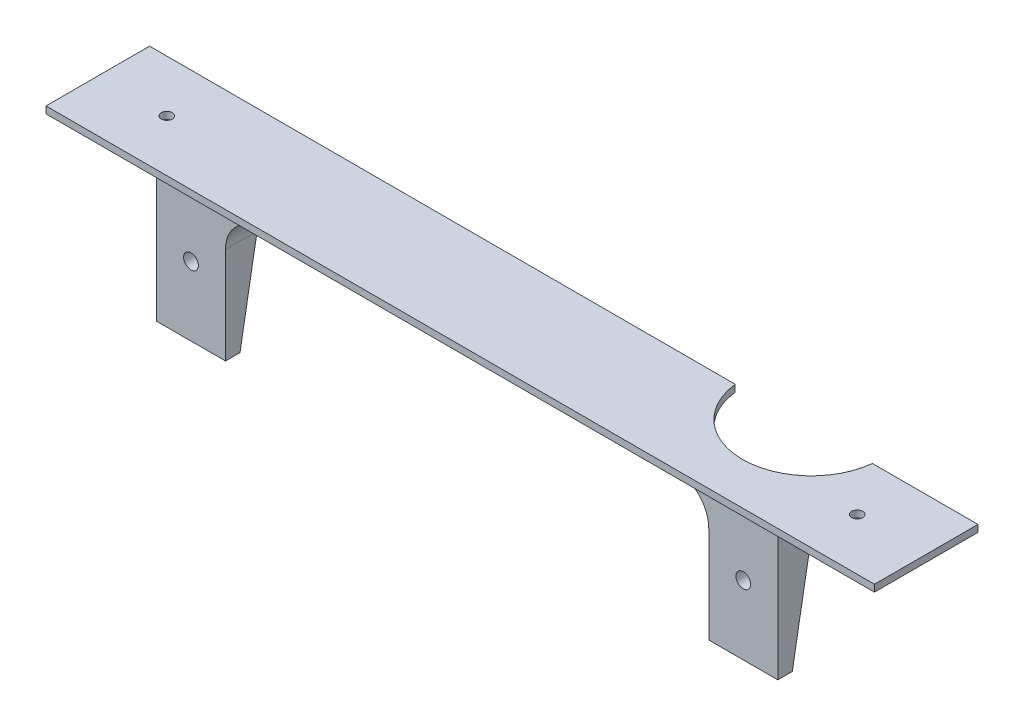
ISO-10303-21;
HEADER;
FILE_DESCRIPTION(('STEP AP214'),'2;1');
FILE_NAME('part.step','',(''),(''),'','','');
FILE_SCHEMA(('AUTOMOTIVE_DESIGN { 1 0 10303 214 1 1 1 1 }'));
ENDSEC;
DATA;
#1=APPLICATION_CONTEXT('core data for automotive mechanical design processes');
#2=APPLICATION_PROTOCOL_DEFINITION('international standard','automotive_design',2000,#1);
#3=PRODUCT_CONTEXT('',#1,'mechanical');
#4=PRODUCT('Part','Part','',(#3));
#5=PRODUCT_RELATED_PRODUCT_CATEGORY('part','',(#4));
#6=PRODUCT_DEFINITION_FORMATION('','',#4);
#7=PRODUCT_DEFINITION_CONTEXT('part definition',#1,'design');
#8=PRODUCT_DEFINITION('design','',#6,#7);
#9=PRODUCT_DEFINITION_SHAPE('','',#8);
#10=(LENGTH_UNIT() NAMED_UNIT(*) SI_UNIT(.MILLI.,.METRE.));
#11=(NAMED_UNIT(*) PLANE_ANGLE_UNIT() SI_UNIT($,.RADIAN.));
#12=(NAMED_UNIT(*) SI_UNIT($,.STERADIAN.) SOLID_ANGLE_UNIT());
#13=UNCERTAINTY_MEASURE_WITH_UNIT(LENGTH_MEASURE(1.E-05),#10,'distance_accuracy_value','');
#14=(GEOMETRIC_REPRESENTATION_CONTEXT(3) GLOBAL_UNCERTAINTY_ASSIGNED_CONTEXT((#13)) GLOBAL_UNIT_ASSIGNED_CONTEXT((#10,
#11,#12)) REPRESENTATION_CONTEXT('',''));
#15=CARTESIAN_POINT('',(0.,0.,0.));
#16=DIRECTION('',(0.,0.,1.));
#17=DIRECTION('',(1.,0.,0.));
#18=AXIS2_PLACEMENT_3D('',#15,#16,#17);
#19=CARTESIAN_POINT('',(0.,0.,-30.));
#20=DIRECTION('',(0.,0.,-1.));
#21=DIRECTION('',(-1.,0.,0.));
#22=AXIS2_PLACEMENT_3D('',#19,#20,#21);
#23=PLANE('',#22);
#24=DIRECTION('',(0.,1.,0.));
#25=VECTOR('',#24,1.);
#26=CARTESIAN_POINT('',(49.6713682563412,-9.,-30.));
#27=LINE('',#26,#25);
#28=CARTESIAN_POINT('',(49.6713682563412,-1.,-30.));
#29=VERTEX_POINT('',#28);
#30=CARTESIAN_POINT('',(49.6713682563412,1.,-30.));
#31=VERTEX_POINT('',#30);
#32=EDGE_CURVE('E179',#29,#31,#27,.T.);
#33=ORIENTED_EDGE('',*,*,#32,.F.);
#34=DIRECTION('',(1.,0.,0.));
#35=VECTOR('',#34,1.);
#36=CARTESIAN_POINT('',(-120.,-1.,-30.));
#37=LINE('',#36,#35);
#38=CARTESIAN_POINT('',(-120.,-1.,-30.));
#39=VERTEX_POINT('',#38);
#40=EDGE_CURVE('E213',#39,#29,#37,.T.);
#41=ORIENTED_EDGE('',*,*,#40,.F.);
#42=DIRECTION('',(0.,1.,0.));
#43=VECTOR('',#42,1.);
#44=CARTESIAN_POINT('',(-120.,-1.,-30.));
#45=LINE('',#44,#43);
#46=CARTESIAN_POINT('',(-120.,1.,-30.));
#47=VERTEX_POINT('',#46);
#48=EDGE_CURVE('E203',#39,#47,#45,.T.);
#49=ORIENTED_EDGE('',*,*,#48,.T.);
#50=DIRECTION('',(1.,0.,0.));
#51=VECTOR('',#50,1.);
#52=CARTESIAN_POINT('',(-120.,1.,-30.));
#53=LINE('',#52,#51);
#54=EDGE_CURVE('E197',#47,#31,#53,.T.);
#55=ORIENTED_EDGE('',*,*,#54,.T.);
#56=EDGE_LOOP('',(#33,#41,#49,#55));
#57=FACE_BOUND('',#56,.T.);
#58=ADVANCED_FACE('F43',(#57),#23,.T.);
#59=CARTESIAN_POINT('',(-90.,-39.,-1.2));
#60=DIRECTION('',(0.,-1.,0.));
#61=DIRECTION('',(0.,0.,-1.));
#62=AXIS2_PLACEMENT_3D('',#59,#60,#61);
#63=PLANE('',#62);
#64=DIRECTION('',(0.,0.,1.));
#65=VECTOR('',#64,1.);
#66=CARTESIAN_POINT('',(70.,-39.,-30.));
#67=LINE('',#66,#65);
#68=CARTESIAN_POINT('',(70.,-39.,-6.20423484597054));
#69=VERTEX_POINT('',#68);
#70=CARTESIAN_POINT('',(70.,-39.,-2.));
#71=VERTEX_POINT('',#70);
#72=EDGE_CURVE('E332',#69,#71,#67,.T.);
#73=ORIENTED_EDGE('',*,*,#72,.F.);
#74=DIRECTION('',(1.,0.,0.));
#75=VECTOR('',#74,1.);
#76=CARTESIAN_POINT('',(90.,-39.,-6.20423484597053));
#77=LINE('',#76,#75);
#78=CARTESIAN_POINT('',(90.,-39.,-6.20423484597053));
#79=VERTEX_POINT('',#78);
#80=EDGE_CURVE('E72',#69,#79,#77,.T.);
#81=ORIENTED_EDGE('',*,*,#80,.T.);
#82=DIRECTION('',(0.,0.,1.));
#83=VECTOR('',#82,1.);
#84=CARTESIAN_POINT('',(90.,-39.,-1.2));
#85=LINE('',#84,#83);
#86=CARTESIAN_POINT('',(90.,-39.,-2.));
#87=VERTEX_POINT('',#86);
#88=EDGE_CURVE('E358',#79,#87,#85,.T.);
#89=ORIENTED_EDGE('',*,*,#88,.T.);
#90=DIRECTION('',(1.,0.,0.));
#91=VECTOR('',#90,1.);
#92=CARTESIAN_POINT('',(-90.,-39.,-2.));
#93=LINE('',#92,#91);
#94=EDGE_CURVE('E341',#71,#87,#93,.T.);
#95=ORIENTED_EDGE('',*,*,#94,.F.);
#96=EDGE_LOOP('',(#73,#81,#89,#95));
#97=FACE_BOUND('',#96,.T.);
#98=ADVANCED_FACE('F423',(#97),#63,.T.);
#99=CARTESIAN_POINT('',(0.,0.,-2.));
#100=DIRECTION('',(0.,0.,1.));
#101=DIRECTION('',(1.,0.,0.));
#102=AXIS2_PLACEMENT_3D('',#99,#100,#101);
#103=PLANE('',#102);
#104=CARTESIAN_POINT('',(80.,-19.,-2.));
#105=DIRECTION('',(0.,0.,1.));
#106=DIRECTION('',(1.,0.,0.));
#107=AXIS2_PLACEMENT_3D('',#104,#105,#106);
#108=CIRCLE('',#107,2.15);
#109=CARTESIAN_POINT('',(82.15,-19.,-2.));
#110=VERTEX_POINT('',#109);
#111=EDGE_CURVE('E298',#110,#110,#108,.T.);
#112=ORIENTED_EDGE('',*,*,#111,.F.);
#113=EDGE_LOOP('',(#112));
#114=FACE_BOUND('',#113,.T.);
#115=DIRECTION('',(0.,1.,0.));
#116=VECTOR('',#115,1.);
#117=CARTESIAN_POINT('',(70.,-39.,-2.));
#118=LINE('',#117,#116);
#119=CARTESIAN_POINT('',(70.,-11.,-2.));
#120=VERTEX_POINT('',#119);
#121=EDGE_CURVE('E273',#71,#120,#118,.T.);
#122=ORIENTED_EDGE('',*,*,#121,.F.);
#123=ORIENTED_EDGE('',*,*,#94,.T.);
#124=DIRECTION('',(0.,1.,0.));
#125=VECTOR('',#124,1.);
#126=CARTESIAN_POINT('',(90.,-1.,-2.));
#127=LINE('',#126,#125);
#128=CARTESIAN_POINT('',(90.,-1.,-2.));
#129=VERTEX_POINT('',#128);
#130=EDGE_CURVE('E343',#87,#129,#127,.T.);
#131=ORIENTED_EDGE('',*,*,#130,.T.);
#132=DIRECTION('',(-1.,0.,0.));
#133=VECTOR('',#132,1.);
#134=CARTESIAN_POINT('',(-90.,-1.,-2.));
#135=LINE('',#134,#133);
#136=CARTESIAN_POINT('',(60.,-1.,-2.));
#137=VERTEX_POINT('',#136);
#138=EDGE_CURVE('E346',#129,#137,#135,.T.);
#139=ORIENTED_EDGE('',*,*,#138,.T.);
#140=CARTESIAN_POINT('',(60.,-11.,-2.));
#141=DIRECTION('',(0.,0.,1.));
#142=DIRECTION('',(1.,0.,0.));
#143=AXIS2_PLACEMENT_3D('',#140,#141,#142);
#144=CIRCLE('',#143,10.);
#145=EDGE_CURVE('E260',#137,#120,#144,.F.);
#146=ORIENTED_EDGE('',*,*,#145,.T.);
#147=EDGE_LOOP('',(#122,#123,#131,#139,#146));
#148=FACE_BOUND('',#147,.T.);
#149=ADVANCED_FACE('F406',(#114,#148),#103,.T.);
#150=CARTESIAN_POINT('',(90.,-1.00000000000001,-1.2));
#151=DIRECTION('',(-1.,0.,0.));
#152=DIRECTION('',(0.,-1.,0.));
#153=AXIS2_PLACEMENT_3D('',#150,#151,#152);
#154=PLANE('',#153);
#155=ORIENTED_EDGE('',*,*,#88,.F.);
#156=DIRECTION('',(0.,-0.98469102705284,0.174308867363719));
#157=VECTOR('',#156,1.);
#158=CARTESIAN_POINT('',(90.,-10.7623939346066,-11.2028232306471));
#159=LINE('',#158,#157);
#160=CARTESIAN_POINT('',(90.,-10.7623939346066,-11.2028232306472));
#161=VERTEX_POINT('',#160);
#162=EDGE_CURVE('E58',#79,#161,#159,.F.);
#163=ORIENTED_EDGE('',*,*,#162,.T.);
#164=CARTESIAN_POINT('',(90.,-11.,-21.2));
#165=DIRECTION('',(-1.,0.,0.));
#166=DIRECTION('',(0.,-1.,0.));
#167=AXIS2_PLACEMENT_3D('',#164,#165,#166);
#168=CIRCLE('',#167,10.);
#169=CARTESIAN_POINT('',(90.,-1.,-21.2));
#170=VERTEX_POINT('',#169);
#171=EDGE_CURVE('E262',#161,#170,#168,.T.);
#172=ORIENTED_EDGE('',*,*,#171,.T.);
#173=DIRECTION('',(0.,0.,1.));
#174=VECTOR('',#173,1.);
#175=CARTESIAN_POINT('',(90.,-1.00000000000001,-1.2));
#176=LINE('',#175,#174);
#177=EDGE_CURVE('E220',#170,#129,#176,.T.);
#178=ORIENTED_EDGE('',*,*,#177,.T.);
#179=ORIENTED_EDGE('',*,*,#130,.F.);
#180=EDGE_LOOP('',(#155,#163,#172,#178,#179));
#181=FACE_BOUND('',#180,.T.);
#182=ADVANCED_FACE('F363',(#181),#154,.F.);
#183=DIRECTION('',(0.,0.,1.));
#184=VECTOR('',#183,1.);
#185=CARTESIAN_POINT('',(-90.,-39.,-1.2));
#186=LINE('',#185,#184);
#187=CARTESIAN_POINT('',(-90.,-39.,-6.20423484597053));
#188=VERTEX_POINT('',#187);
#189=CARTESIAN_POINT('',(-90.,-39.,-2.));
#190=VERTEX_POINT('',#189);
#191=EDGE_CURVE('E356',#188,#190,#186,.T.);
#192=ORIENTED_EDGE('',*,*,#191,.F.);
#193=DIRECTION('',(1.,0.,0.));
#194=VECTOR('',#193,1.);
#195=CARTESIAN_POINT('',(-70.,-39.,-6.20423484597053));
#196=LINE('',#195,#194);
#197=CARTESIAN_POINT('',(-70.,-39.,-6.20423484597054));
#198=VERTEX_POINT('',#197);
#199=EDGE_CURVE('E281',#188,#198,#196,.T.);
#200=ORIENTED_EDGE('',*,*,#199,.T.);
#201=DIRECTION('',(0.,0.,1.));
#202=VECTOR('',#201,1.);
#203=CARTESIAN_POINT('',(-70.,-39.,-30.));
#204=LINE('',#203,#202);
#205=CARTESIAN_POINT('',(-70.,-39.,-2.));
#206=VERTEX_POINT('',#205);
#207=EDGE_CURVE('E319',#198,#206,#204,.T.);
#208=ORIENTED_EDGE('',*,*,#207,.T.);
#209=EDGE_CURVE('E330',#190,#206,#93,.T.);
#210=ORIENTED_EDGE('',*,*,#209,.F.);
#211=EDGE_LOOP('',(#192,#200,#208,#210));
#212=FACE_BOUND('',#211,.T.);
#213=ADVANCED_FACE('F418',(#212),#63,.T.);
#214=CARTESIAN_POINT('',(-90.,-1.00000000000001,-1.2));
#215=DIRECTION('',(-1.,0.,0.));
#216=DIRECTION('',(0.,0.,1.));
#217=AXIS2_PLACEMENT_3D('',#214,#215,#216);
#218=PLANE('',#217);
#219=CARTESIAN_POINT('',(-90.,-11.,-21.2));
#220=DIRECTION('',(-1.,0.,0.));
#221=DIRECTION('',(0.,0.,1.));
#222=AXIS2_PLACEMENT_3D('',#219,#220,#221);
#223=CIRCLE('',#222,10.);
#224=CARTESIAN_POINT('',(-90.,-1.00000000000001,-21.2));
#225=VERTEX_POINT('',#224);
#226=CARTESIAN_POINT('',(-90.,-10.7623939346066,-11.2028232306472));
#227=VERTEX_POINT('',#226);
#228=EDGE_CURVE('E267',#225,#227,#223,.F.);
#229=ORIENTED_EDGE('',*,*,#228,.T.);
#230=DIRECTION('',(0.,0.98469102705284,-0.174308867363719));
#231=VECTOR('',#230,1.);
#232=CARTESIAN_POINT('',(-90.,-3.01350484588724,-12.5745226198701));
#233=LINE('',#232,#231);
#234=EDGE_CURVE('E279',#227,#188,#233,.F.);
#235=ORIENTED_EDGE('',*,*,#234,.T.);
#236=ORIENTED_EDGE('',*,*,#191,.T.);
#237=DIRECTION('',(0.,-1.,0.));
#238=VECTOR('',#237,1.);
#239=CARTESIAN_POINT('',(-90.,-1.,-2.));
#240=LINE('',#239,#238);
#241=CARTESIAN_POINT('',(-90.,-1.00000000000001,-2.));
#242=VERTEX_POINT('',#241);
#243=EDGE_CURVE('E338',#242,#190,#240,.T.);
#244=ORIENTED_EDGE('',*,*,#243,.F.);
#245=DIRECTION('',(0.,0.,1.));
#246=VECTOR('',#245,1.);
#247=CARTESIAN_POINT('',(-90.,-1.00000000000001,-1.2));
#248=LINE('',#247,#246);
#249=EDGE_CURVE('E244',#225,#242,#248,.T.);
#250=ORIENTED_EDGE('',*,*,#249,.F.);
#251=EDGE_LOOP('',(#229,#235,#236,#244,#250));
#252=FACE_BOUND('',#251,.T.);
#253=ADVANCED_FACE('F415',(#252),#218,.T.);
#254=CARTESIAN_POINT('',(-120.,-1.,-30.));
#255=DIRECTION('',(0.,-1.,0.));
#256=DIRECTION('',(0.,0.,-1.));
#257=AXIS2_PLACEMENT_3D('',#254,#255,#256);
#258=PLANE('',#257);
#259=CARTESIAN_POINT('',(69.55,-1.,-32.2));
#260=DIRECTION('',(0.,-1.,0.));
#261=DIRECTION('',(0.,0.,-1.));
#262=AXIS2_PLACEMENT_3D('',#259,#260,#261);
#263=CIRCLE('',#262,20.);
#264=CARTESIAN_POINT('',(89.4286317436588,-1.,-30.));
#265=VERTEX_POINT('',#264);
#266=CARTESIAN_POINT('',(86.2532930884901,-0.999999999999999,-21.2));
#267=VERTEX_POINT('',#266);
#268=EDGE_CURVE('E376',#265,#267,#263,.T.);
#269=ORIENTED_EDGE('',*,*,#268,.F.);
#270=CARTESIAN_POINT('',(120.,-1.,-30.));
#271=VERTEX_POINT('',#270);
#272=EDGE_CURVE('E208',#265,#271,#37,.T.);
#273=ORIENTED_EDGE('',*,*,#272,.T.);
#274=DIRECTION('',(0.,0.,1.));
#275=VECTOR('',#274,1.);
#276=CARTESIAN_POINT('',(120.,-1.,-30.));
#277=LINE('',#276,#275);
#278=CARTESIAN_POINT('',(120.,-1.,0.));
#279=VERTEX_POINT('',#278);
#280=EDGE_CURVE('E229',#271,#279,#277,.T.);
#281=ORIENTED_EDGE('',*,*,#280,.T.);
#282=DIRECTION('',(1.,0.,0.));
#283=VECTOR('',#282,1.);
#284=CARTESIAN_POINT('',(-120.,-1.,0.));
#285=LINE('',#284,#283);
#286=CARTESIAN_POINT('',(-120.,-1.,0.));
#287=VERTEX_POINT('',#286);
#288=EDGE_CURVE('E226',#287,#279,#285,.T.);
#289=ORIENTED_EDGE('',*,*,#288,.F.);
#290=DIRECTION('',(0.,0.,1.));
#291=VECTOR('',#290,1.);
#292=CARTESIAN_POINT('',(-120.,-1.,-30.));
#293=LINE('',#292,#291);
#294=EDGE_CURVE('E215',#39,#287,#293,.T.);
#295=ORIENTED_EDGE('',*,*,#294,.F.);
#296=ORIENTED_EDGE('',*,*,#40,.T.);
#297=CARTESIAN_POINT('',(60.,-0.999999999999999,-14.6273650239926));
#298=VERTEX_POINT('',#297);
#299=EDGE_CURVE('E185',#298,#29,#263,.T.);
#300=ORIENTED_EDGE('',*,*,#299,.F.);
#301=DIRECTION('',(0.,0.,1.));
#302=VECTOR('',#301,1.);
#303=CARTESIAN_POINT('',(60.,-1.,-30.));
#304=LINE('',#303,#302);
#305=EDGE_CURVE('E253',#298,#137,#304,.T.);
#306=ORIENTED_EDGE('',*,*,#305,.T.);
#307=ORIENTED_EDGE('',*,*,#138,.F.);
#308=ORIENTED_EDGE('',*,*,#177,.F.);
#309=DIRECTION('',(1.,0.,0.));
#310=VECTOR('',#309,1.);
#311=CARTESIAN_POINT('',(70.,-1.,-21.2));
#312=LINE('',#311,#310);
#313=EDGE_CURVE('E250',#170,#267,#312,.F.);
#314=ORIENTED_EDGE('',*,*,#313,.T.);
#315=EDGE_LOOP('',(#269,#273,#281,#289,#295,#296,#300,#306,#307,#308,#314));
#316=FACE_BOUND('',#315,.T.);
#317=CARTESIAN_POINT('',(-60.,-1.,-2.));
#318=VERTEX_POINT('',#317);
#319=EDGE_CURVE('E345',#318,#242,#135,.T.);
#320=ORIENTED_EDGE('',*,*,#319,.F.);
#321=DIRECTION('',(0.,0.,1.));
#322=VECTOR('',#321,1.);
#323=CARTESIAN_POINT('',(-60.,-1.,-30.));
#324=LINE('',#323,#322);
#325=CARTESIAN_POINT('',(-60.,-1.,-21.2));
#326=VERTEX_POINT('',#325);
#327=EDGE_CURVE('E247',#318,#326,#324,.F.);
#328=ORIENTED_EDGE('',*,*,#327,.T.);
#329=DIRECTION('',(1.,0.,0.));
#330=VECTOR('',#329,1.);
#331=CARTESIAN_POINT('',(-90.,-1.,-21.2));
#332=LINE('',#331,#330);
#333=EDGE_CURVE('E236',#326,#225,#332,.F.);
#334=ORIENTED_EDGE('',*,*,#333,.T.);
#335=ORIENTED_EDGE('',*,*,#249,.T.);
#336=EDGE_LOOP('',(#320,#328,#334,#335));
#337=FACE_BOUND('',#336,.T.);
#338=CARTESIAN_POINT('',(-100.,-1.,-15.));
#339=DIRECTION('',(0.,-1.,0.));
#340=DIRECTION('',(0.,0.,-1.));
#341=AXIS2_PLACEMENT_3D('',#338,#339,#340);
#342=CIRCLE('',#341,1.6);
#343=CARTESIAN_POINT('',(-100.,-1.,-16.6));
#344=VERTEX_POINT('',#343);
#345=EDGE_CURVE('E240',#344,#344,#342,.T.);
#346=ORIENTED_EDGE('',*,*,#345,.F.);
#347=EDGE_LOOP('',(#346));
#348=FACE_BOUND('',#347,.T.);
#349=CARTESIAN_POINT('',(100.,-1.,-15.));
#350=DIRECTION('',(0.,-1.,0.));
#351=DIRECTION('',(0.,0.,-1.));
#352=AXIS2_PLACEMENT_3D('',#349,#350,#351);
#353=CIRCLE('',#352,1.6);
#354=CARTESIAN_POINT('',(100.,-1.,-16.6));
#355=VERTEX_POINT('',#354);
#356=EDGE_CURVE('E237',#355,#355,#353,.T.);
#357=ORIENTED_EDGE('',*,*,#356,.F.);
#358=EDGE_LOOP('',(#357));
#359=FACE_BOUND('',#358,.T.);
#360=ADVANCED_FACE('F369',(#316,#337,#348,#359),#258,.T.);
#361=CARTESIAN_POINT('',(-120.,-1.,-30.));
#362=DIRECTION('',(1.,0.,0.));
#363=DIRECTION('',(0.,0.,-1.));
#364=AXIS2_PLACEMENT_3D('',#361,#362,#363);
#365=PLANE('',#364);
#366=DIRECTION('',(0.,1.,0.));
#367=VECTOR('',#366,1.);
#368=CARTESIAN_POINT('',(-120.,-1.,0.));
#369=LINE('',#368,#367);
#370=CARTESIAN_POINT('',(-120.,1.,0.));
#371=VERTEX_POINT('',#370);
#372=EDGE_CURVE('E216',#287,#371,#369,.T.);
#373=ORIENTED_EDGE('',*,*,#372,.T.);
#374=DIRECTION('',(0.,0.,1.));
#375=VECTOR('',#374,1.);
#376=CARTESIAN_POINT('',(-120.,1.,-30.));
#377=LINE('',#376,#375);
#378=EDGE_CURVE('E234',#47,#371,#377,.T.);
#379=ORIENTED_EDGE('',*,*,#378,.F.);
#380=ORIENTED_EDGE('',*,*,#48,.F.);
#381=ORIENTED_EDGE('',*,*,#294,.T.);
#382=EDGE_LOOP('',(#373,#379,#380,#381));
#383=FACE_BOUND('',#382,.T.);
#384=ADVANCED_FACE('F436',(#383),#365,.F.);
#385=CARTESIAN_POINT('',(-120.,1.,-30.));
#386=DIRECTION('',(0.,-1.,0.));
#387=DIRECTION('',(0.,0.,-1.));
#388=AXIS2_PLACEMENT_3D('',#385,#386,#387);
#389=PLANE('',#388);
#390=CARTESIAN_POINT('',(-100.,1.,-15.));
#391=DIRECTION('',(0.,1.,0.));
#392=DIRECTION('',(0.,0.,1.));
#393=AXIS2_PLACEMENT_3D('',#390,#391,#392);
#394=CIRCLE('',#393,1.6);
#395=CARTESIAN_POINT('',(-100.,1.,-13.4));
#396=VERTEX_POINT('',#395);
#397=EDGE_CURVE('E241',#396,#396,#394,.T.);
#398=ORIENTED_EDGE('',*,*,#397,.F.);
#399=EDGE_LOOP('',(#398));
#400=FACE_BOUND('',#399,.T.);
#401=CARTESIAN_POINT('',(100.,1.,-15.));
#402=DIRECTION('',(0.,1.,0.));
#403=DIRECTION('',(0.,0.,1.));
#404=AXIS2_PLACEMENT_3D('',#401,#402,#403);
#405=CIRCLE('',#404,1.6);
#406=CARTESIAN_POINT('',(100.,1.,-13.4));
#407=VERTEX_POINT('',#406);
#408=EDGE_CURVE('E349',#407,#407,#405,.T.);
#409=ORIENTED_EDGE('',*,*,#408,.F.);
#410=EDGE_LOOP('',(#409));
#411=FACE_BOUND('',#410,.T.);
#412=CARTESIAN_POINT('',(89.4286317436588,1.,-30.));
#413=VERTEX_POINT('',#412);
#414=CARTESIAN_POINT('',(120.,1.,-30.));
#415=VERTEX_POINT('',#414);
#416=EDGE_CURVE('E200',#413,#415,#53,.T.);
#417=ORIENTED_EDGE('',*,*,#416,.F.);
#418=CARTESIAN_POINT('',(69.55,1.,-32.2));
#419=DIRECTION('',(0.,1.,0.));
#420=DIRECTION('',(0.,0.,-1.));
#421=AXIS2_PLACEMENT_3D('',#418,#419,#420);
#422=CIRCLE('',#421,20.);
#423=EDGE_CURVE('E182',#31,#413,#422,.T.);
#424=ORIENTED_EDGE('',*,*,#423,.F.);
#425=ORIENTED_EDGE('',*,*,#54,.F.);
#426=ORIENTED_EDGE('',*,*,#378,.T.);
#427=DIRECTION('',(1.,0.,0.));
#428=VECTOR('',#427,1.);
#429=CARTESIAN_POINT('',(-120.,1.,0.));
#430=LINE('',#429,#428);
#431=CARTESIAN_POINT('',(120.,1.,0.));
#432=VERTEX_POINT('',#431);
#433=EDGE_CURVE('E219',#371,#432,#430,.T.);
#434=ORIENTED_EDGE('',*,*,#433,.T.);
#435=DIRECTION('',(0.,0.,1.));
#436=VECTOR('',#435,1.);
#437=CARTESIAN_POINT('',(120.,1.,-30.));
#438=LINE('',#437,#436);
#439=EDGE_CURVE('E232',#415,#432,#438,.T.);
#440=ORIENTED_EDGE('',*,*,#439,.F.);
#441=EDGE_LOOP('',(#417,#424,#425,#426,#434,#440));
#442=FACE_BOUND('',#441,.T.);
#443=ADVANCED_FACE('F195',(#400,#411,#442),#389,.F.);
#444=CARTESIAN_POINT('',(120.,-1.,-30.));
#445=DIRECTION('',(1.,0.,0.));
#446=DIRECTION('',(0.,0.,-1.));
#447=AXIS2_PLACEMENT_3D('',#444,#445,#446);
#448=PLANE('',#447);
#449=DIRECTION('',(0.,1.,0.));
#450=VECTOR('',#449,1.);
#451=CARTESIAN_POINT('',(120.,-1.,0.));
#452=LINE('',#451,#450);
#453=EDGE_CURVE('E223',#279,#432,#452,.T.);
#454=ORIENTED_EDGE('',*,*,#453,.F.);
#455=ORIENTED_EDGE('',*,*,#280,.F.);
#456=DIRECTION('',(0.,1.,0.));
#457=VECTOR('',#456,1.);
#458=CARTESIAN_POINT('',(120.,-1.,-30.));
#459=LINE('',#458,#457);
#460=EDGE_CURVE('E205',#271,#415,#459,.T.);
#461=ORIENTED_EDGE('',*,*,#460,.T.);
#462=ORIENTED_EDGE('',*,*,#439,.T.);
#463=EDGE_LOOP('',(#454,#455,#461,#462));
#464=FACE_BOUND('',#463,.T.);
#465=ADVANCED_FACE('F429',(#464),#448,.T.);
#466=DIRECTION('',(0.,1.,0.));
#467=VECTOR('',#466,1.);
#468=CARTESIAN_POINT('',(89.4286317436588,-9.,-30.));
#469=LINE('',#468,#467);
#470=EDGE_CURVE('E191',#413,#265,#469,.F.);
#471=ORIENTED_EDGE('',*,*,#470,.F.);
#472=ORIENTED_EDGE('',*,*,#416,.T.);
#473=ORIENTED_EDGE('',*,*,#460,.F.);
#474=ORIENTED_EDGE('',*,*,#272,.F.);
#475=EDGE_LOOP('',(#471,#472,#473,#474));
#476=FACE_BOUND('',#475,.T.);
#477=ADVANCED_FACE('F426',(#476),#23,.T.);
#478=CARTESIAN_POINT('',(0.,0.,0.));
#479=DIRECTION('',(0.,0.,-1.));
#480=DIRECTION('',(-1.,0.,0.));
#481=AXIS2_PLACEMENT_3D('',#478,#479,#480);
#482=PLANE('',#481);
#483=ORIENTED_EDGE('',*,*,#288,.T.);
#484=ORIENTED_EDGE('',*,*,#453,.T.);
#485=ORIENTED_EDGE('',*,*,#433,.F.);
#486=ORIENTED_EDGE('',*,*,#372,.F.);
#487=EDGE_LOOP('',(#483,#484,#485,#486));
#488=FACE_BOUND('',#487,.T.);
#489=ADVANCED_FACE('F413',(#488),#482,.F.);
#490=CARTESIAN_POINT('',(100.,-39.,-15.));
#491=DIRECTION('',(0.,1.,0.));
#492=DIRECTION('',(0.,0.,1.));
#493=AXIS2_PLACEMENT_3D('',#490,#491,#492);
#494=CYLINDRICAL_SURFACE('',#493,1.6);
#495=ORIENTED_EDGE('',*,*,#356,.T.);
#496=EDGE_LOOP('',(#495));
#497=FACE_BOUND('',#496,.T.);
#498=ORIENTED_EDGE('',*,*,#408,.T.);
#499=EDGE_LOOP('',(#498));
#500=FACE_BOUND('',#499,.T.);
#501=ADVANCED_FACE('F409',(#497,#500),#494,.F.);
#502=CARTESIAN_POINT('',(-100.,-39.,-15.));
#503=DIRECTION('',(0.,1.,0.));
#504=DIRECTION('',(0.,0.,1.));
#505=AXIS2_PLACEMENT_3D('',#502,#503,#504);
#506=CYLINDRICAL_SURFACE('',#505,1.6);
#507=ORIENTED_EDGE('',*,*,#345,.T.);
#508=EDGE_LOOP('',(#507));
#509=FACE_BOUND('',#508,.T.);
#510=ORIENTED_EDGE('',*,*,#397,.T.);
#511=EDGE_LOOP('',(#510));
#512=FACE_BOUND('',#511,.T.);
#513=ADVANCED_FACE('F404',(#509,#512),#506,.F.);
#514=CARTESIAN_POINT('',(-80.,-19.,-2.));
#515=DIRECTION('',(0.,0.,1.));
#516=DIRECTION('',(1.,0.,0.));
#517=AXIS2_PLACEMENT_3D('',#514,#515,#516);
#518=CIRCLE('',#517,2.15);
#519=CARTESIAN_POINT('',(-77.85,-19.,-2.));
#520=VERTEX_POINT('',#519);
#521=EDGE_CURVE('E190',#520,#520,#518,.T.);
#522=ORIENTED_EDGE('',*,*,#521,.F.);
#523=EDGE_LOOP('',(#522));
#524=FACE_BOUND('',#523,.T.);
#525=DIRECTION('',(0.,-1.,0.));
#526=VECTOR('',#525,1.);
#527=CARTESIAN_POINT('',(-70.,-39.,-2.));
#528=LINE('',#527,#526);
#529=CARTESIAN_POINT('',(-70.,-11.,-2.));
#530=VERTEX_POINT('',#529);
#531=EDGE_CURVE('E326',#530,#206,#528,.T.);
#532=ORIENTED_EDGE('',*,*,#531,.F.);
#533=CARTESIAN_POINT('',(-60.,-11.,-2.));
#534=DIRECTION('',(0.,0.,1.));
#535=DIRECTION('',(1.,0.,0.));
#536=AXIS2_PLACEMENT_3D('',#533,#534,#535);
#537=CIRCLE('',#536,10.);
#538=EDGE_CURVE('E264',#530,#318,#537,.F.);
#539=ORIENTED_EDGE('',*,*,#538,.T.);
#540=ORIENTED_EDGE('',*,*,#319,.T.);
#541=ORIENTED_EDGE('',*,*,#243,.T.);
#542=ORIENTED_EDGE('',*,*,#209,.T.);
#543=EDGE_LOOP('',(#532,#539,#540,#541,#542));
#544=FACE_BOUND('',#543,.T.);
#545=ADVANCED_FACE('F327',(#524,#544),#103,.T.);
#546=CARTESIAN_POINT('',(70.,-39.,-30.));
#547=DIRECTION('',(1.,0.,0.));
#548=DIRECTION('',(0.,0.,-1.));
#549=AXIS2_PLACEMENT_3D('',#546,#547,#548);
#550=PLANE('',#549);
#551=DIRECTION('',(0.,0.,1.));
#552=VECTOR('',#551,1.);
#553=CARTESIAN_POINT('',(70.,-11.,-30.));
#554=LINE('',#553,#552);
#555=CARTESIAN_POINT('',(70.,-11.,-11.1607624796099));
#556=VERTEX_POINT('',#555);
#557=EDGE_CURVE('E255',#120,#556,#554,.F.);
#558=ORIENTED_EDGE('',*,*,#557,.T.);
#559=DIRECTION('',(0.,0.98469102705284,-0.174308867363719));
#560=VECTOR('',#559,1.);
#561=CARTESIAN_POINT('',(70.,-10.7623939346066,-11.2028232306472));
#562=LINE('',#561,#560);
#563=EDGE_CURVE('E292',#556,#69,#562,.F.);
#564=ORIENTED_EDGE('',*,*,#563,.T.);
#565=ORIENTED_EDGE('',*,*,#72,.T.);
#566=ORIENTED_EDGE('',*,*,#121,.T.);
#567=EDGE_LOOP('',(#558,#564,#565,#566));
#568=FACE_BOUND('',#567,.T.);
#569=ADVANCED_FACE('F398',(#568),#550,.F.);
#570=CARTESIAN_POINT('',(-70.,-39.,-30.));
#571=DIRECTION('',(-1.,0.,0.));
#572=DIRECTION('',(0.,0.,1.));
#573=AXIS2_PLACEMENT_3D('',#570,#571,#572);
#574=PLANE('',#573);
#575=ORIENTED_EDGE('',*,*,#207,.F.);
#576=DIRECTION('',(0.,-0.98469102705284,0.174308867363719));
#577=VECTOR('',#576,1.);
#578=CARTESIAN_POINT('',(-70.,-10.7623939346066,-11.2028232306472));
#579=LINE('',#578,#577);
#580=CARTESIAN_POINT('',(-70.,-11.,-11.1607624796099));
#581=VERTEX_POINT('',#580);
#582=EDGE_CURVE('E283',#198,#581,#579,.F.);
#583=ORIENTED_EDGE('',*,*,#582,.T.);
#584=DIRECTION('',(0.,0.,1.));
#585=VECTOR('',#584,1.);
#586=CARTESIAN_POINT('',(-70.,-11.,-30.));
#587=LINE('',#586,#585);
#588=EDGE_CURVE('E258',#581,#530,#587,.T.);
#589=ORIENTED_EDGE('',*,*,#588,.T.);
#590=ORIENTED_EDGE('',*,*,#531,.T.);
#591=EDGE_LOOP('',(#575,#583,#589,#590));
#592=FACE_BOUND('',#591,.T.);
#593=ADVANCED_FACE('F316',(#592),#574,.F.);
#594=CARTESIAN_POINT('',(0.,-11.,-21.2));
#595=DIRECTION('',(-1.,0.,0.));
#596=DIRECTION('',(0.,0.,1.));
#597=AXIS2_PLACEMENT_3D('',#594,#595,#596);
#598=CYLINDRICAL_SURFACE('',#597,10.);
#599=CARTESIAN_POINT('',(60.,-11.,-21.2));
#600=DIRECTION('',(-0.707106781186547,0.,0.707106781186547));
#601=DIRECTION('',(-0.707106781186547,0.,-0.707106781186547));
#602=AXIS2_PLACEMENT_3D('',#599,#600,#601);
#603=ELLIPSE('',#602,14.1421356237309,10.);
#604=CARTESIAN_POINT('',(68.9922205388166,-6.62507488277981,-12.2077794611834));
#605=VERTEX_POINT('',#604);
#606=CARTESIAN_POINT('',(69.9971767693528,-10.7623939346066,-11.2028232306472));
#607=VERTEX_POINT('',#606);
#608=EDGE_CURVE('E271',#605,#607,#603,.F.);
#609=ORIENTED_EDGE('',*,*,#608,.F.);
#610=CARTESIAN_POINT('',(59.82,-3.37816598697512,-14.7263884671771));
#611=CARTESIAN_POINT('',(60.076401689746,-3.49939997912934,-14.5836314332797));
#612=CARTESIAN_POINT('',(60.3352487332298,-3.62247680543249,-14.4468709312497));
#613=CARTESIAN_POINT('',(60.8578556080008,-3.87080858025255,-14.1852232331236));
#614=CARTESIAN_POINT('',(61.1216154441157,-3.99606353090986,-14.0603360486959));
#615=CARTESIAN_POINT('',(61.6558331951716,-4.24807578006461,-13.8215270826764));
#616=CARTESIAN_POINT('',(61.9263239078262,-4.37483753412172,-13.7076834263854));
#617=CARTESIAN_POINT('',(62.4724956309269,-4.6272557465506,-13.4918422076408));
#618=CARTESIAN_POINT('',(62.7481765750238,-4.75291221902164,-13.3898444938739));
#619=CARTESIAN_POINT('',(63.3186157659656,-5.00705938164491,-13.193020441187));
#620=CARTESIAN_POINT('',(63.6136496248372,-5.1353905367169,-13.0987844241712));
#621=CARTESIAN_POINT('',(64.2104055185978,-5.38555378652067,-12.9234476938633));
#622=CARTESIAN_POINT('',(64.5121288284846,-5.50738462696498,-12.8423495095175));
#623=CARTESIAN_POINT('',(65.121950275497,-5.74032976711845,-12.6938325814801));
#624=CARTESIAN_POINT('',(65.4300265242588,-5.85147517896734,-12.6263734514034));
#625=CARTESIAN_POINT('',(66.0538491435141,-6.0585348688835,-12.5053868346428));
#626=CARTESIAN_POINT('',(66.3695910906712,-6.15445770080572,-12.4518515130249));
#627=CARTESIAN_POINT('',(66.9768915688917,-6.31659730473677,-12.3640848316925));
#628=CARTESIAN_POINT('',(67.2677005686838,-6.38482826410956,-12.3284561314819));
#629=CARTESIAN_POINT('',(67.8548955870469,-6.49940136255764,-12.2697818635934));
#630=CARTESIAN_POINT('',(68.1512802199398,-6.54574886737771,-12.2467332111163));
#631=CARTESIAN_POINT('',(68.7430656021149,-6.61190071296601,-12.214124165353));
#632=CARTESIAN_POINT('',(69.0384080182046,-6.6321125335401,-12.2043565803552));
#633=CARTESIAN_POINT('',(69.6298643874267,-6.64528052034402,-12.1979733464491));
#634=CARTESIAN_POINT('',(69.9259783416179,-6.63823664915429,-12.201357715597));
#635=CARTESIAN_POINT('',(70.5161414002466,-6.59761482867327,-12.2211646909001));
#636=CARTESIAN_POINT('',(70.810188462238,-6.56401357518414,-12.2375987482624));
#637=CARTESIAN_POINT('',(71.3936346341255,-6.47344364111362,-12.2830045384497));
#638=CARTESIAN_POINT('',(71.6830327597637,-6.4164700782482,-12.3119788909093));
#639=CARTESIAN_POINT('',(72.2585517479584,-6.28294662276932,-12.3821138970972));
#640=CARTESIAN_POINT('',(72.5446169024298,-6.20621917173917,-12.4233856455247));
#641=CARTESIAN_POINT('',(73.110519787525,-6.03798383188012,-12.5173925803374));
#642=CARTESIAN_POINT('',(73.3903544038867,-5.9464687323006,-12.5701333636119));
#643=CARTESIAN_POINT('',(73.937533484433,-5.75490336545164,-12.6852386153417));
#644=CARTESIAN_POINT('',(74.2050171974387,-5.65509755335082,-12.7473540898915));
#645=CARTESIAN_POINT('',(74.7345089786172,-5.44827616643482,-12.8817325260063));
#646=CARTESIAN_POINT('',(74.9965179468958,-5.34126178920006,-12.9539938041712));
#647=CARTESIAN_POINT('',(75.515769775203,-5.12236569010062,-13.1085611973987));
#648=CARTESIAN_POINT('',(75.7730082378115,-5.01047976753556,-13.1908760966136));
#649=CARTESIAN_POINT('',(76.2828531340926,-4.78390024544104,-13.365423554329));
#650=CARTESIAN_POINT('',(76.5354590569389,-4.66920633949502,-13.4576571989553));
#651=CARTESIAN_POINT('',(77.286539332124,-4.32353348248506,-13.7491308007556));
#652=CARTESIAN_POINT('',(77.7785510649435,-4.09084352157979,-13.9632255065759));
#653=CARTESIAN_POINT('',(78.7458109959895,-3.6316325294851,-14.4313359177082));
#654=CARTESIAN_POINT('',(79.2210681767768,-3.40510820805064,-14.685329820859));
#655=CARTESIAN_POINT('',(80.0744126582862,-3.00437269082088,-15.187127325687));
#656=CARTESIAN_POINT('',(80.455183781402,-2.82785332047632,-15.4285190467695));
#657=CARTESIAN_POINT('',(81.2040422446959,-2.48965394134048,-15.939960838397));
#658=CARTESIAN_POINT('',(81.5721280646615,-2.32797570728212,-16.2100143280697));
#659=CARTESIAN_POINT('',(82.2922558968035,-2.02518894092643,-16.7778018667134));
#660=CARTESIAN_POINT('',(82.644363461159,-1.88398990305261,-17.0754039670587));
#661=CARTESIAN_POINT('',(83.3319984550978,-1.62671354646395,-17.6992492786117));
#662=CARTESIAN_POINT('',(83.667532409046,-1.51062628044464,-18.0254810767394));
#663=CARTESIAN_POINT('',(84.1989648849911,-1.34664385391805,-18.5802980006371));
#664=CARTESIAN_POINT('',(84.400736638829,-1.28938680322264,-18.8005402963345));
#665=CARTESIAN_POINT('',(84.7956302254085,-1.18892570371787,-19.251619154664));
#666=CARTESIAN_POINT('',(84.9887555371697,-1.14571595814962,-19.4824513791983));
#667=CARTESIAN_POINT('',(85.3667219843244,-1.07481722087557,-19.9556751468688));
#668=CARTESIAN_POINT('',(85.5515006272918,-1.04723166285283,-20.1981324572464));
#669=CARTESIAN_POINT('',(85.910578633201,-1.00981321745722,-20.6923837796938));
#670=CARTESIAN_POINT('',(86.0848666700679,-0.999999195983352,-20.9441874246993));
#671=CARTESIAN_POINT('',(86.2532930884901,-0.999999999999999,-21.2));
#672=B_SPLINE_CURVE_WITH_KNOTS('',3,(#610,#611,#612,#613,#614,#615,#616,#617,#618,#619,#620,
#621,#622,#623,#624,#625,#626,#627,#628,#629,#630,#631,#632,#633,#634,#635,#636,#637,#638,#639,
#640,#641,#642,#643,#644,#645,#646,#647,#648,#649,#650,#651,#652,#653,#654,#655,#656,#657,#658,
#659,#660,#661,#662,#663,#664,#665,#666,#667,#668,#669,#670,#671),.UNSPECIFIED.,.F.,.F.,(4,2,2,
2,2,2,2,2,2,2,2,2,2,2,2,2,2,2,2,2,2,2,2,2,2,2,2,2,2,2,4),(0.,0.952464231119473,1.90492939825257,
2.86370450601539,3.8224673655909,4.82787538615053,5.83347671175519,6.83605529181969,
7.83806849386447,8.7396121403903,9.64093461669513,10.528028129461,11.4151228601249,
12.3029968849939,13.1910564739948,14.0873954589168,14.9841728428192,15.8603430084759,
16.7363679706691,17.6131638926888,18.490055923877,20.2429096213121,21.9948088155979,
23.4461926860704,24.8977498904587,26.3426827023738,27.787042093416,28.6988933776021,
29.6103744060179,30.5278210421848,31.4462410512083),.UNSPECIFIED.);
#673=EDGE_CURVE('E65',#605,#267,#672,.T.);
#674=ORIENTED_EDGE('',*,*,#673,.T.);
#675=ORIENTED_EDGE('',*,*,#313,.F.);
#676=ORIENTED_EDGE('',*,*,#171,.F.);
#677=DIRECTION('',(-1.,0.,0.));
#678=VECTOR('',#677,1.);
#679=CARTESIAN_POINT('',(0.,-10.7623939346066,-11.2028232306472));
#680=LINE('',#679,#678);
#681=EDGE_CURVE('E287',#161,#607,#680,.T.);
#682=ORIENTED_EDGE('',*,*,#681,.T.);
#683=EDGE_LOOP('',(#609,#674,#675,#676,#682));
#684=FACE_BOUND('',#683,.T.);
#685=ADVANCED_FACE('F373',(#684),#598,.F.);
#686=CARTESIAN_POINT('',(60.,-11.,-30.));
#687=DIRECTION('',(0.,0.,1.));
#688=DIRECTION('',(1.,0.,0.));
#689=AXIS2_PLACEMENT_3D('',#686,#687,#688);
#690=CYLINDRICAL_SURFACE('',#689,10.);
#691=ORIENTED_EDGE('',*,*,#305,.F.);
#692=CARTESIAN_POINT('',(60.,-0.999999999999999,-14.6273650239926));
#693=CARTESIAN_POINT('',(60.2415197316132,-0.999969616109192,-14.496058827349));
#694=CARTESIAN_POINT('',(60.4858521525286,-1.0087502470795,-14.3697737622747));
#695=CARTESIAN_POINT('',(60.9785133577763,-1.0449309572061,-14.1277974112286));
#696=CARTESIAN_POINT('',(61.2268443128893,-1.07234150769712,-14.0121121246035));
#697=CARTESIAN_POINT('',(61.7258444596012,-1.14681854243101,-13.7919271636662));
#698=CARTESIAN_POINT('',(61.9765157205183,-1.19390443639754,-13.6874386632248));
#699=CARTESIAN_POINT('',(62.4777857512015,-1.30842394829451,-13.4902089844879));
#700=CARTESIAN_POINT('',(62.7283845252515,-1.37585336471436,-13.3974653861491));
#701=CARTESIAN_POINT('',(63.2282186390191,-1.53176910663706,-13.2235573819091));
#702=CARTESIAN_POINT('',(63.4774451326256,-1.62033476617103,-13.1424384904533));
#703=CARTESIAN_POINT('',(63.9711361043893,-1.81845197727185,-12.9921144219843));
#704=CARTESIAN_POINT('',(64.2156002237258,-1.92800510345214,-12.9229101396211));
#705=CARTESIAN_POINT('',(64.6969296951548,-2.16761524814206,-12.7961455409708));
#706=CARTESIAN_POINT('',(64.9338055365776,-2.29764235068651,-12.7385685111747));
#707=CARTESIAN_POINT('',(65.397937340421,-2.57766526888012,-12.6342913549708));
#708=CARTESIAN_POINT('',(65.6251938246523,-2.72765999953315,-12.5875906379474));
#709=CARTESIAN_POINT('',(66.0564629288402,-3.03845287172865,-12.5063243931474));
#710=CARTESIAN_POINT('',(66.261069869299,-3.19829722463348,-12.4712578796729));
#711=CARTESIAN_POINT('',(66.6579071132313,-3.53408889090615,-12.4091905735525));
#712=CARTESIAN_POINT('',(66.8501377191637,-3.71003581049694,-12.3821895837386));
#713=CARTESIAN_POINT('',(67.2208652726035,-4.07705193048369,-12.3352047908372));
#714=CARTESIAN_POINT('',(67.3993487180831,-4.2681356334293,-12.3152278195801));
#715=CARTESIAN_POINT('',(67.7410261753032,-4.66400118670374,-12.2812375507281));
#716=CARTESIAN_POINT('',(67.9042201747693,-4.86878304802931,-12.2672242579209));
#717=CARTESIAN_POINT('',(68.2177057059252,-5.29552762546785,-12.24379120207));
#718=CARTESIAN_POINT('',(68.3676162415734,-5.51777637395737,-12.2344839664561));
#719=CARTESIAN_POINT('',(68.6491609319393,-5.97368925501083,-12.2198005853373));
#720=CARTESIAN_POINT('',(68.7807945928151,-6.20735369579665,-12.2144245460366));
#721=CARTESIAN_POINT('',(69.0247346118124,-6.68423646304178,-12.2065266238047));
#722=CARTESIAN_POINT('',(69.1370645443206,-6.92744268420291,-12.204001238252));
#723=CARTESIAN_POINT('',(69.3418160488243,-7.42200360719967,-12.2008214189045));
#724=CARTESIAN_POINT('',(69.4342461395227,-7.67335476912989,-12.2001661830597));
#725=CARTESIAN_POINT('',(69.5732688642013,-8.10401067378365,-12.1999327254979));
#726=CARTESIAN_POINT('',(69.6252043008104,-8.28161064141261,-12.2000845287494));
#727=CARTESIAN_POINT('',(69.7190743891295,-8.63912937226324,-12.2006613763879));
#728=CARTESIAN_POINT('',(69.7610249372733,-8.81904396249563,-12.2010859824173));
#729=CARTESIAN_POINT('',(69.7979589711327,-9.,-12.2015371503549));
#730=B_SPLINE_CURVE_WITH_KNOTS('',3,(#692,#693,#694,#695,#696,#697,#698,#699,#700,#701,#702,
#703,#704,#705,#706,#707,#708,#709,#710,#711,#712,#713,#714,#715,#716,#717,#718,#719,#720,#721,
#722,#723,#724,#725,#726,#727,#728,#729),.UNSPECIFIED.,.F.,.F.,(4,2,2,2,2,2,2,2,2,2,2,2,2,2,2,2,
2,2,4),(0.,0.824625332608609,1.64971454680575,2.47561964021395,3.30135427757916,
4.13023842154114,4.95918477804423,5.7869309544474,6.61463217132449,7.39971972044388,
8.18478807592119,8.97061792038817,9.75644839571764,10.5602724207006,11.364118160812,
12.1669751303562,12.9694877273591,13.5243339887232,14.0782909088615),.UNSPECIFIED.);
#731=EDGE_CURVE('E11',#298,#605,#730,.T.);
#732=ORIENTED_EDGE('',*,*,#731,.T.);
#733=ORIENTED_EDGE('',*,*,#608,.T.);
#734=CARTESIAN_POINT('',(60.,-11.,-11.1607624796099));
#735=DIRECTION('',(0.,0.174308867363719,0.98469102705284));
#736=DIRECTION('',(0.,-0.98469102705284,0.174308867363719));
#737=AXIS2_PLACEMENT_3D('',#734,#735,#736);
#738=ELLIPSE('',#737,10.1554698126272,10.);
#739=EDGE_CURVE('E290',#607,#556,#738,.F.);
#740=ORIENTED_EDGE('',*,*,#739,.T.);
#741=ORIENTED_EDGE('',*,*,#557,.F.);
#742=ORIENTED_EDGE('',*,*,#145,.F.);
#743=EDGE_LOOP('',(#691,#732,#733,#740,#741,#742));
#744=FACE_BOUND('',#743,.T.);
#745=ADVANCED_FACE('F445',(#744),#690,.F.);
#746=CARTESIAN_POINT('',(0.,-11.,-21.2));
#747=DIRECTION('',(-1.,0.,0.));
#748=DIRECTION('',(0.,0.,1.));
#749=AXIS2_PLACEMENT_3D('',#746,#747,#748);
#750=CYLINDRICAL_SURFACE('',#749,10.);
#751=CARTESIAN_POINT('',(-60.,-11.,-21.2));
#752=DIRECTION('',(-0.707106781186547,0.,-0.707106781186547));
#753=DIRECTION('',(-0.707106781186547,0.,0.707106781186547));
#754=AXIS2_PLACEMENT_3D('',#751,#752,#753);
#755=ELLIPSE('',#754,14.1421356237309,10.);
#756=CARTESIAN_POINT('',(-69.9971767693528,-10.7623939346066,-11.2028232306472));
#757=VERTEX_POINT('',#756);
#758=EDGE_CURVE('E274',#757,#326,#755,.T.);
#759=ORIENTED_EDGE('',*,*,#758,.F.);
#760=DIRECTION('',(-1.,0.,0.));
#761=VECTOR('',#760,1.);
#762=CARTESIAN_POINT('',(0.,-10.7623939346066,-11.2028232306472));
#763=LINE('',#762,#761);
#764=EDGE_CURVE('E270',#757,#227,#763,.T.);
#765=ORIENTED_EDGE('',*,*,#764,.T.);
#766=ORIENTED_EDGE('',*,*,#228,.F.);
#767=ORIENTED_EDGE('',*,*,#333,.F.);
#768=EDGE_LOOP('',(#759,#765,#766,#767));
#769=FACE_BOUND('',#768,.T.);
#770=ADVANCED_FACE('F448',(#769),#750,.F.);
#771=CARTESIAN_POINT('',(-60.,-11.,-30.));
#772=DIRECTION('',(0.,0.,1.));
#773=DIRECTION('',(1.,0.,0.));
#774=AXIS2_PLACEMENT_3D('',#771,#772,#773);
#775=CYLINDRICAL_SURFACE('',#774,10.);
#776=ORIENTED_EDGE('',*,*,#588,.F.);
#777=CARTESIAN_POINT('',(-60.,-11.,-11.1607624796099));
#778=DIRECTION('',(0.,0.174308867363719,0.98469102705284));
#779=DIRECTION('',(0.,-0.98469102705284,0.174308867363719));
#780=AXIS2_PLACEMENT_3D('',#777,#778,#779);
#781=ELLIPSE('',#780,10.1554698126272,10.);
#782=EDGE_CURVE('E285',#581,#757,#781,.F.);
#783=ORIENTED_EDGE('',*,*,#782,.T.);
#784=ORIENTED_EDGE('',*,*,#758,.T.);
#785=ORIENTED_EDGE('',*,*,#327,.F.);
#786=ORIENTED_EDGE('',*,*,#538,.F.);
#787=EDGE_LOOP('',(#776,#783,#784,#785,#786));
#788=FACE_BOUND('',#787,.T.);
#789=ADVANCED_FACE('F308',(#788),#775,.F.);
#790=CARTESIAN_POINT('',(0.,-10.7623939346066,-11.2028232306472));
#791=DIRECTION('',(0.,0.174308867363719,0.98469102705284));
#792=DIRECTION('',(-1.,0.,0.));
#793=AXIS2_PLACEMENT_3D('',#790,#791,#792);
#794=PLANE('',#793);
#795=CARTESIAN_POINT('',(-80.,-19.,-9.74461172714151));
#796=DIRECTION('',(0.,0.174308867363719,0.98469102705284));
#797=DIRECTION('',(0.,-0.98469102705284,0.174308867363719));
#798=AXIS2_PLACEMENT_3D('',#795,#796,#797);
#799=ELLIPSE('',#798,2.18342600971485,2.15);
#800=CARTESIAN_POINT('',(-80.,-21.15,-9.36402121241563));
#801=VERTEX_POINT('',#800);
#802=EDGE_CURVE('E276',#801,#801,#799,.F.);
#803=ORIENTED_EDGE('',*,*,#802,.F.);
#804=EDGE_LOOP('',(#803));
#805=FACE_BOUND('',#804,.T.);
#806=ORIENTED_EDGE('',*,*,#582,.F.);
#807=ORIENTED_EDGE('',*,*,#199,.F.);
#808=ORIENTED_EDGE('',*,*,#234,.F.);
#809=ORIENTED_EDGE('',*,*,#764,.F.);
#810=ORIENTED_EDGE('',*,*,#782,.F.);
#811=EDGE_LOOP('',(#806,#807,#808,#809,#810));
#812=FACE_BOUND('',#811,.T.);
#813=ADVANCED_FACE('F305',(#805,#812),#794,.F.);
#814=CARTESIAN_POINT('',(0.,-10.7623939346066,-11.2028232306472));
#815=DIRECTION('',(0.,0.174308867363719,0.98469102705284));
#816=DIRECTION('',(-1.,0.,0.));
#817=AXIS2_PLACEMENT_3D('',#814,#815,#816);
#818=PLANE('',#817);
#819=CARTESIAN_POINT('',(80.,-19.,-9.74461172714151));
#820=DIRECTION('',(0.,0.174308867363719,0.98469102705284));
#821=DIRECTION('',(0.,-0.98469102705284,0.174308867363719));
#822=AXIS2_PLACEMENT_3D('',#819,#820,#821);
#823=ELLIPSE('',#822,2.18342600971485,2.15);
#824=CARTESIAN_POINT('',(80.,-21.15,-9.36402121241563));
#825=VERTEX_POINT('',#824);
#826=EDGE_CURVE('E296',#825,#825,#823,.F.);
#827=ORIENTED_EDGE('',*,*,#826,.F.);
#828=EDGE_LOOP('',(#827));
#829=FACE_BOUND('',#828,.T.);
#830=ORIENTED_EDGE('',*,*,#162,.F.);
#831=ORIENTED_EDGE('',*,*,#80,.F.);
#832=ORIENTED_EDGE('',*,*,#563,.F.);
#833=ORIENTED_EDGE('',*,*,#739,.F.);
#834=ORIENTED_EDGE('',*,*,#681,.F.);
#835=EDGE_LOOP('',(#830,#831,#832,#833,#834));
#836=FACE_BOUND('',#835,.T.);
#837=ADVANCED_FACE('F46',(#829,#836),#818,.F.);
#838=CARTESIAN_POINT('',(80.,-19.,-30.));
#839=DIRECTION('',(0.,0.,1.));
#840=DIRECTION('',(1.,0.,0.));
#841=AXIS2_PLACEMENT_3D('',#838,#839,#840);
#842=CYLINDRICAL_SURFACE('',#841,2.15);
#843=ORIENTED_EDGE('',*,*,#826,.T.);
#844=EDGE_LOOP('',(#843));
#845=FACE_BOUND('',#844,.T.);
#846=ORIENTED_EDGE('',*,*,#111,.T.);
#847=EDGE_LOOP('',(#846));
#848=FACE_BOUND('',#847,.T.);
#849=ADVANCED_FACE('F389',(#845,#848),#842,.F.);
#850=CARTESIAN_POINT('',(-80.,-19.,-30.));
#851=DIRECTION('',(0.,0.,1.));
#852=DIRECTION('',(1.,0.,0.));
#853=AXIS2_PLACEMENT_3D('',#850,#851,#852);
#854=CYLINDRICAL_SURFACE('',#853,2.15);
#855=ORIENTED_EDGE('',*,*,#802,.T.);
#856=EDGE_LOOP('',(#855));
#857=FACE_BOUND('',#856,.T.);
#858=ORIENTED_EDGE('',*,*,#521,.T.);
#859=EDGE_LOOP('',(#858));
#860=FACE_BOUND('',#859,.T.);
#861=ADVANCED_FACE('F302',(#857,#860),#854,.F.);
#862=CARTESIAN_POINT('',(69.55,-9.,-32.2));
#863=DIRECTION('',(0.,1.,0.));
#864=DIRECTION('',(0.,0.,1.));
#865=AXIS2_PLACEMENT_3D('',#862,#863,#864);
#866=CYLINDRICAL_SURFACE('',#865,20.);
#867=ORIENTED_EDGE('',*,*,#32,.T.);
#868=ORIENTED_EDGE('',*,*,#423,.T.);
#869=ORIENTED_EDGE('',*,*,#470,.T.);
#870=ORIENTED_EDGE('',*,*,#268,.T.);
#871=ORIENTED_EDGE('',*,*,#673,.F.);
#872=ORIENTED_EDGE('',*,*,#731,.F.);
#873=ORIENTED_EDGE('',*,*,#299,.T.);
#874=EDGE_LOOP('',(#867,#868,#869,#870,#871,#872,#873));
#875=FACE_BOUND('',#874,.T.);
#876=ADVANCED_FACE('F181',(#875),#866,.F.);
#877=CLOSED_SHELL('',(#58,#98,#149,#182,#213,#253,#360,#384,#443,#465,#477,#489,#501,#513,#545,
#569,#593,#685,#745,#770,#789,#813,#837,#849,#861,#876));
#878=MANIFOLD_SOLID_BREP('B2',#877);
#879=ADVANCED_BREP_SHAPE_REPRESENTATION('',(#18,#878),#14);
#880=SHAPE_DEFINITION_REPRESENTATION(#9,#879);
ENDSEC;
END-ISO-10303-21;
